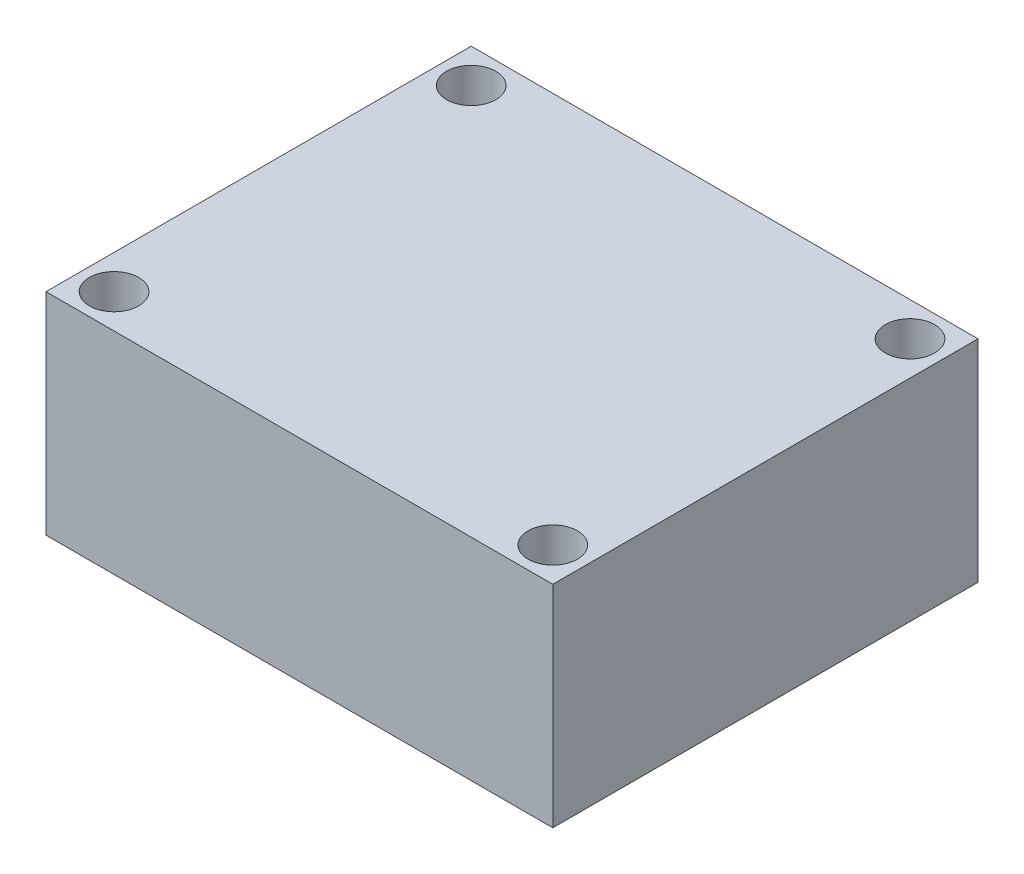
ISO-10303-21;
HEADER;
FILE_DESCRIPTION(('STEP AP214'),'2;1');
FILE_NAME('part.step','',(''),(''),'','','');
FILE_SCHEMA(('AUTOMOTIVE_DESIGN { 1 0 10303 214 1 1 1 1 }'));
ENDSEC;
DATA;
#1=APPLICATION_CONTEXT('core data for automotive mechanical design processes');
#2=APPLICATION_PROTOCOL_DEFINITION('international standard','automotive_design',2000,#1);
#3=PRODUCT_CONTEXT('',#1,'mechanical');
#4=PRODUCT('Part','Part','',(#3));
#5=PRODUCT_RELATED_PRODUCT_CATEGORY('part','',(#4));
#6=PRODUCT_DEFINITION_FORMATION('','',#4);
#7=PRODUCT_DEFINITION_CONTEXT('part definition',#1,'design');
#8=PRODUCT_DEFINITION('design','',#6,#7);
#9=PRODUCT_DEFINITION_SHAPE('','',#8);
#10=(LENGTH_UNIT() NAMED_UNIT(*) SI_UNIT(.MILLI.,.METRE.));
#11=(NAMED_UNIT(*) PLANE_ANGLE_UNIT() SI_UNIT($,.RADIAN.));
#12=(NAMED_UNIT(*) SI_UNIT($,.STERADIAN.) SOLID_ANGLE_UNIT());
#13=UNCERTAINTY_MEASURE_WITH_UNIT(LENGTH_MEASURE(1.E-05),#10,'distance_accuracy_value','');
#14=(GEOMETRIC_REPRESENTATION_CONTEXT(3) GLOBAL_UNCERTAINTY_ASSIGNED_CONTEXT((#13)) GLOBAL_UNIT_ASSIGNED_CONTEXT((#10,
#11,#12)) REPRESENTATION_CONTEXT('',''));
#15=CARTESIAN_POINT('',(0.,0.,0.));
#16=DIRECTION('',(0.,0.,1.));
#17=DIRECTION('',(1.,0.,0.));
#18=AXIS2_PLACEMENT_3D('',#15,#16,#17);
#19=CARTESIAN_POINT('',(18.923,7.874,15.875));
#20=DIRECTION('',(-1.,0.,0.));
#21=DIRECTION('',(0.,0.,1.));
#22=AXIS2_PLACEMENT_3D('',#19,#20,#21);
#23=PLANE('',#22);
#24=DIRECTION('',(0.,0.,-1.));
#25=VECTOR('',#24,1.);
#26=CARTESIAN_POINT('',(18.923,-7.874,15.875));
#27=LINE('',#26,#25);
#28=CARTESIAN_POINT('',(18.923,-7.874,15.875));
#29=VERTEX_POINT('',#28);
#30=CARTESIAN_POINT('',(18.923,-7.874,-15.875));
#31=VERTEX_POINT('',#30);
#32=EDGE_CURVE('E97',#29,#31,#27,.T.);
#33=ORIENTED_EDGE('',*,*,#32,.T.);
#34=DIRECTION('',(0.,-1.,0.));
#35=VECTOR('',#34,1.);
#36=CARTESIAN_POINT('',(18.923,7.874,-15.875));
#37=LINE('',#36,#35);
#38=CARTESIAN_POINT('',(18.923,7.874,-15.875));
#39=VERTEX_POINT('',#38);
#40=EDGE_CURVE('E11',#39,#31,#37,.T.);
#41=ORIENTED_EDGE('',*,*,#40,.F.);
#42=DIRECTION('',(0.,0.,-1.));
#43=VECTOR('',#42,1.);
#44=CARTESIAN_POINT('',(18.923,7.874,15.875));
#45=LINE('',#44,#43);
#46=CARTESIAN_POINT('',(18.923,7.874,15.875));
#47=VERTEX_POINT('',#46);
#48=EDGE_CURVE('E85',#47,#39,#45,.T.);
#49=ORIENTED_EDGE('',*,*,#48,.F.);
#50=DIRECTION('',(0.,-1.,0.));
#51=VECTOR('',#50,1.);
#52=CARTESIAN_POINT('',(18.923,7.874,15.875));
#53=LINE('',#52,#51);
#54=EDGE_CURVE('E93',#47,#29,#53,.T.);
#55=ORIENTED_EDGE('',*,*,#54,.T.);
#56=EDGE_LOOP('',(#33,#41,#49,#55));
#57=FACE_BOUND('',#56,.T.);
#58=ADVANCED_FACE('F34',(#57),#23,.F.);
#59=CARTESIAN_POINT('',(-18.923,7.874,-15.875));
#60=DIRECTION('',(0.,0.,1.));
#61=DIRECTION('',(1.,0.,0.));
#62=AXIS2_PLACEMENT_3D('',#59,#60,#61);
#63=PLANE('',#62);
#64=DIRECTION('',(-1.,0.,0.));
#65=VECTOR('',#64,1.);
#66=CARTESIAN_POINT('',(-18.923,-7.874,-15.875));
#67=LINE('',#66,#65);
#68=CARTESIAN_POINT('',(-18.923,-7.874,-15.875));
#69=VERTEX_POINT('',#68);
#70=EDGE_CURVE('E89',#31,#69,#67,.T.);
#71=ORIENTED_EDGE('',*,*,#70,.T.);
#72=DIRECTION('',(0.,-1.,0.));
#73=VECTOR('',#72,1.);
#74=CARTESIAN_POINT('',(-18.923,7.874,-15.875));
#75=LINE('',#74,#73);
#76=CARTESIAN_POINT('',(-18.923,7.874,-15.875));
#77=VERTEX_POINT('',#76);
#78=EDGE_CURVE('E42',#77,#69,#75,.T.);
#79=ORIENTED_EDGE('',*,*,#78,.F.);
#80=DIRECTION('',(-1.,0.,0.));
#81=VECTOR('',#80,1.);
#82=CARTESIAN_POINT('',(-18.923,7.874,-15.875));
#83=LINE('',#82,#81);
#84=EDGE_CURVE('E80',#39,#77,#83,.T.);
#85=ORIENTED_EDGE('',*,*,#84,.F.);
#86=ORIENTED_EDGE('',*,*,#40,.T.);
#87=EDGE_LOOP('',(#71,#79,#85,#86));
#88=FACE_BOUND('',#87,.T.);
#89=ADVANCED_FACE('F88',(#88),#63,.F.);
#90=CARTESIAN_POINT('',(-18.923,7.874,15.875));
#91=DIRECTION('',(1.,0.,0.));
#92=DIRECTION('',(0.,0.,-1.));
#93=AXIS2_PLACEMENT_3D('',#90,#91,#92);
#94=PLANE('',#93);
#95=DIRECTION('',(0.,0.,1.));
#96=VECTOR('',#95,1.);
#97=CARTESIAN_POINT('',(-18.923,-7.874,15.875));
#98=LINE('',#97,#96);
#99=CARTESIAN_POINT('',(-18.923,-7.874,15.875));
#100=VERTEX_POINT('',#99);
#101=EDGE_CURVE('E67',#69,#100,#98,.T.);
#102=ORIENTED_EDGE('',*,*,#101,.T.);
#103=DIRECTION('',(0.,-1.,0.));
#104=VECTOR('',#103,1.);
#105=CARTESIAN_POINT('',(-18.923,7.874,15.875));
#106=LINE('',#105,#104);
#107=CARTESIAN_POINT('',(-18.923,7.874,15.875));
#108=VERTEX_POINT('',#107);
#109=EDGE_CURVE('E90',#108,#100,#106,.T.);
#110=ORIENTED_EDGE('',*,*,#109,.F.);
#111=DIRECTION('',(0.,0.,1.));
#112=VECTOR('',#111,1.);
#113=CARTESIAN_POINT('',(-18.923,7.874,15.875));
#114=LINE('',#113,#112);
#115=EDGE_CURVE('E83',#77,#108,#114,.T.);
#116=ORIENTED_EDGE('',*,*,#115,.F.);
#117=ORIENTED_EDGE('',*,*,#78,.T.);
#118=EDGE_LOOP('',(#102,#110,#116,#117));
#119=FACE_BOUND('',#118,.T.);
#120=ADVANCED_FACE('F91',(#119),#94,.F.);
#121=CARTESIAN_POINT('',(-18.923,7.874,15.875));
#122=DIRECTION('',(0.,0.,-1.));
#123=DIRECTION('',(-1.,0.,0.));
#124=AXIS2_PLACEMENT_3D('',#121,#122,#123);
#125=PLANE('',#124);
#126=DIRECTION('',(1.,0.,0.));
#127=VECTOR('',#126,1.);
#128=CARTESIAN_POINT('',(-18.923,-7.874,15.875));
#129=LINE('',#128,#127);
#130=EDGE_CURVE('E73',#100,#29,#129,.T.);
#131=ORIENTED_EDGE('',*,*,#130,.T.);
#132=ORIENTED_EDGE('',*,*,#54,.F.);
#133=DIRECTION('',(1.,0.,0.));
#134=VECTOR('',#133,1.);
#135=CARTESIAN_POINT('',(-18.923,7.874,15.875));
#136=LINE('',#135,#134);
#137=EDGE_CURVE('E50',#108,#47,#136,.T.);
#138=ORIENTED_EDGE('',*,*,#137,.F.);
#139=ORIENTED_EDGE('',*,*,#109,.T.);
#140=EDGE_LOOP('',(#131,#132,#138,#139));
#141=FACE_BOUND('',#140,.T.);
#142=ADVANCED_FACE('F105',(#141),#125,.F.);
#143=CARTESIAN_POINT('',(18.923,7.874,-15.875));
#144=DIRECTION('',(0.,-1.,0.));
#145=DIRECTION('',(0.,0.,-1.));
#146=AXIS2_PLACEMENT_3D('',#143,#144,#145);
#147=PLANE('',#146);
#148=CARTESIAN_POINT('',(-16.383,7.874,-13.335));
#149=DIRECTION('',(0.,-1.,0.));
#150=DIRECTION('',(0.,0.,1.));
#151=AXIS2_PLACEMENT_3D('',#148,#149,#150);
#152=CIRCLE('',#151,1.8415);
#153=CARTESIAN_POINT('',(-16.383,7.874,-11.4935));
#154=VERTEX_POINT('',#153);
#155=EDGE_CURVE('E126',#154,#154,#152,.T.);
#156=ORIENTED_EDGE('',*,*,#155,.T.);
#157=EDGE_LOOP('',(#156));
#158=FACE_BOUND('',#157,.T.);
#159=CARTESIAN_POINT('',(16.383,7.874,-13.335));
#160=DIRECTION('',(0.,-1.,0.));
#161=DIRECTION('',(0.,0.,-1.));
#162=AXIS2_PLACEMENT_3D('',#159,#160,#161);
#163=CIRCLE('',#162,1.8415);
#164=CARTESIAN_POINT('',(16.383,7.874,-15.1765));
#165=VERTEX_POINT('',#164);
#166=EDGE_CURVE('E120',#165,#165,#163,.T.);
#167=ORIENTED_EDGE('',*,*,#166,.T.);
#168=EDGE_LOOP('',(#167));
#169=FACE_BOUND('',#168,.T.);
#170=CARTESIAN_POINT('',(16.383,7.874,13.335));
#171=DIRECTION('',(0.,-1.,0.));
#172=DIRECTION('',(0.,0.,1.));
#173=AXIS2_PLACEMENT_3D('',#170,#171,#172);
#174=CIRCLE('',#173,1.8415);
#175=CARTESIAN_POINT('',(16.383,7.874,15.1765));
#176=VERTEX_POINT('',#175);
#177=EDGE_CURVE('E114',#176,#176,#174,.T.);
#178=ORIENTED_EDGE('',*,*,#177,.T.);
#179=EDGE_LOOP('',(#178));
#180=FACE_BOUND('',#179,.T.);
#181=CARTESIAN_POINT('',(-16.383,7.874,13.335));
#182=DIRECTION('',(0.,-1.,0.));
#183=DIRECTION('',(0.,0.,-1.));
#184=AXIS2_PLACEMENT_3D('',#181,#182,#183);
#185=CIRCLE('',#184,1.8415);
#186=CARTESIAN_POINT('',(-16.383,7.874,11.4935));
#187=VERTEX_POINT('',#186);
#188=EDGE_CURVE('E100',#187,#187,#185,.T.);
#189=ORIENTED_EDGE('',*,*,#188,.T.);
#190=EDGE_LOOP('',(#189));
#191=FACE_BOUND('',#190,.T.);
#192=ORIENTED_EDGE('',*,*,#48,.T.);
#193=ORIENTED_EDGE('',*,*,#84,.T.);
#194=ORIENTED_EDGE('',*,*,#115,.T.);
#195=ORIENTED_EDGE('',*,*,#137,.T.);
#196=EDGE_LOOP('',(#192,#193,#194,#195));
#197=FACE_BOUND('',#196,.T.);
#198=ADVANCED_FACE('F81',(#158,#169,#180,#191,#197),#147,.F.);
#199=CARTESIAN_POINT('',(18.923,-7.874,-15.875));
#200=DIRECTION('',(0.,-1.,0.));
#201=DIRECTION('',(0.,0.,-1.));
#202=AXIS2_PLACEMENT_3D('',#199,#200,#201);
#203=PLANE('',#202);
#204=CARTESIAN_POINT('',(-16.383,-7.874,-13.335));
#205=DIRECTION('',(0.,-1.,0.));
#206=DIRECTION('',(0.,0.,1.));
#207=AXIS2_PLACEMENT_3D('',#204,#205,#206);
#208=CIRCLE('',#207,1.8415);
#209=CARTESIAN_POINT('',(-16.383,-7.874,-11.4935));
#210=VERTEX_POINT('',#209);
#211=EDGE_CURVE('E129',#210,#210,#208,.T.);
#212=ORIENTED_EDGE('',*,*,#211,.F.);
#213=EDGE_LOOP('',(#212));
#214=FACE_BOUND('',#213,.T.);
#215=CARTESIAN_POINT('',(16.383,-7.874,-13.335));
#216=DIRECTION('',(0.,-1.,0.));
#217=DIRECTION('',(0.,0.,-1.));
#218=AXIS2_PLACEMENT_3D('',#215,#216,#217);
#219=CIRCLE('',#218,1.8415);
#220=CARTESIAN_POINT('',(16.383,-7.874,-15.1765));
#221=VERTEX_POINT('',#220);
#222=EDGE_CURVE('E123',#221,#221,#219,.T.);
#223=ORIENTED_EDGE('',*,*,#222,.F.);
#224=EDGE_LOOP('',(#223));
#225=FACE_BOUND('',#224,.T.);
#226=CARTESIAN_POINT('',(16.383,-7.874,13.335));
#227=DIRECTION('',(0.,-1.,0.));
#228=DIRECTION('',(0.,0.,1.));
#229=AXIS2_PLACEMENT_3D('',#226,#227,#228);
#230=CIRCLE('',#229,1.8415);
#231=CARTESIAN_POINT('',(16.383,-7.874,15.1765));
#232=VERTEX_POINT('',#231);
#233=EDGE_CURVE('E117',#232,#232,#230,.T.);
#234=ORIENTED_EDGE('',*,*,#233,.F.);
#235=EDGE_LOOP('',(#234));
#236=FACE_BOUND('',#235,.T.);
#237=CARTESIAN_POINT('',(-16.383,-7.874,13.335));
#238=DIRECTION('',(0.,-1.,0.));
#239=DIRECTION('',(0.,0.,-1.));
#240=AXIS2_PLACEMENT_3D('',#237,#238,#239);
#241=CIRCLE('',#240,1.8415);
#242=CARTESIAN_POINT('',(-16.383,-7.874,11.4935));
#243=VERTEX_POINT('',#242);
#244=EDGE_CURVE('E111',#243,#243,#241,.T.);
#245=ORIENTED_EDGE('',*,*,#244,.F.);
#246=EDGE_LOOP('',(#245));
#247=FACE_BOUND('',#246,.T.);
#248=ORIENTED_EDGE('',*,*,#32,.F.);
#249=ORIENTED_EDGE('',*,*,#130,.F.);
#250=ORIENTED_EDGE('',*,*,#101,.F.);
#251=ORIENTED_EDGE('',*,*,#70,.F.);
#252=EDGE_LOOP('',(#248,#249,#250,#251));
#253=FACE_BOUND('',#252,.T.);
#254=ADVANCED_FACE('F108',(#214,#225,#236,#247,#253),#203,.T.);
#255=CARTESIAN_POINT('',(-16.383,7.874,13.335));
#256=DIRECTION('',(0.,-1.,0.));
#257=DIRECTION('',(0.,0.,-1.));
#258=AXIS2_PLACEMENT_3D('',#255,#256,#257);
#259=CYLINDRICAL_SURFACE('',#258,1.8415);
#260=ORIENTED_EDGE('',*,*,#188,.F.);
#261=EDGE_LOOP('',(#260));
#262=FACE_BOUND('',#261,.T.);
#263=ORIENTED_EDGE('',*,*,#244,.T.);
#264=EDGE_LOOP('',(#263));
#265=FACE_BOUND('',#264,.T.);
#266=ADVANCED_FACE('F146',(#262,#265),#259,.F.);
#267=CARTESIAN_POINT('',(16.383,7.874,13.335));
#268=DIRECTION('',(0.,-1.,0.));
#269=DIRECTION('',(0.,0.,-1.));
#270=AXIS2_PLACEMENT_3D('',#267,#268,#269);
#271=CYLINDRICAL_SURFACE('',#270,1.8415);
#272=ORIENTED_EDGE('',*,*,#177,.F.);
#273=EDGE_LOOP('',(#272));
#274=FACE_BOUND('',#273,.T.);
#275=ORIENTED_EDGE('',*,*,#233,.T.);
#276=EDGE_LOOP('',(#275));
#277=FACE_BOUND('',#276,.T.);
#278=ADVANCED_FACE('F155',(#274,#277),#271,.F.);
#279=CARTESIAN_POINT('',(16.383,7.874,-13.335));
#280=DIRECTION('',(0.,-1.,0.));
#281=DIRECTION('',(0.,0.,-1.));
#282=AXIS2_PLACEMENT_3D('',#279,#280,#281);
#283=CYLINDRICAL_SURFACE('',#282,1.8415);
#284=ORIENTED_EDGE('',*,*,#166,.F.);
#285=EDGE_LOOP('',(#284));
#286=FACE_BOUND('',#285,.T.);
#287=ORIENTED_EDGE('',*,*,#222,.T.);
#288=EDGE_LOOP('',(#287));
#289=FACE_BOUND('',#288,.T.);
#290=ADVANCED_FACE('F140',(#286,#289),#283,.F.);
#291=CARTESIAN_POINT('',(-16.383,7.874,-13.335));
#292=DIRECTION('',(0.,-1.,0.));
#293=DIRECTION('',(0.,0.,-1.));
#294=AXIS2_PLACEMENT_3D('',#291,#292,#293);
#295=CYLINDRICAL_SURFACE('',#294,1.8415);
#296=ORIENTED_EDGE('',*,*,#155,.F.);
#297=EDGE_LOOP('',(#296));
#298=FACE_BOUND('',#297,.T.);
#299=ORIENTED_EDGE('',*,*,#211,.T.);
#300=EDGE_LOOP('',(#299));
#301=FACE_BOUND('',#300,.T.);
#302=ADVANCED_FACE('F137',(#298,#301),#295,.F.);
#303=CLOSED_SHELL('',(#58,#89,#120,#142,#198,#254,#266,#278,#290,#302));
#304=MANIFOLD_SOLID_BREP('B2',#303);
#305=ADVANCED_BREP_SHAPE_REPRESENTATION('',(#18,#304),#14);
#306=SHAPE_DEFINITION_REPRESENTATION(#9,#305);
ENDSEC;
END-ISO-10303-21;
